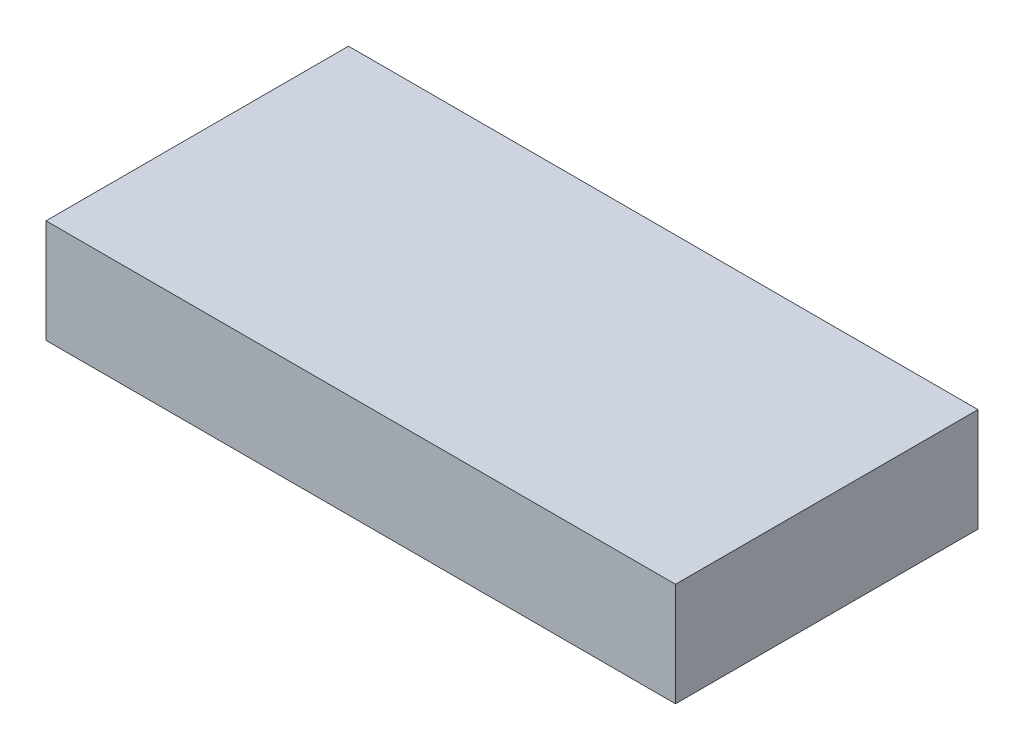
ISO-10303-21;
HEADER;
FILE_DESCRIPTION(('STEP AP214'),'2;1');
FILE_NAME('part.step','',(''),(''),'','','');
FILE_SCHEMA(('AUTOMOTIVE_DESIGN { 1 0 10303 214 1 1 1 1 }'));
ENDSEC;
DATA;
#1=APPLICATION_CONTEXT('core data for automotive mechanical design processes');
#2=APPLICATION_PROTOCOL_DEFINITION('international standard','automotive_design',2000,#1);
#3=PRODUCT_CONTEXT('',#1,'mechanical');
#4=PRODUCT('Part','Part','',(#3));
#5=PRODUCT_RELATED_PRODUCT_CATEGORY('part','',(#4));
#6=PRODUCT_DEFINITION_FORMATION('','',#4);
#7=PRODUCT_DEFINITION_CONTEXT('part definition',#1,'design');
#8=PRODUCT_DEFINITION('design','',#6,#7);
#9=PRODUCT_DEFINITION_SHAPE('','',#8);
#10=(LENGTH_UNIT() NAMED_UNIT(*) SI_UNIT(.MILLI.,.METRE.));
#11=(NAMED_UNIT(*) PLANE_ANGLE_UNIT() SI_UNIT($,.RADIAN.));
#12=(NAMED_UNIT(*) SI_UNIT($,.STERADIAN.) SOLID_ANGLE_UNIT());
#13=UNCERTAINTY_MEASURE_WITH_UNIT(LENGTH_MEASURE(1.E-05),#10,'distance_accuracy_value','');
#14=(GEOMETRIC_REPRESENTATION_CONTEXT(3) GLOBAL_UNCERTAINTY_ASSIGNED_CONTEXT((#13)) GLOBAL_UNIT_ASSIGNED_CONTEXT((#10,
#11,#12)) REPRESENTATION_CONTEXT('',''));
#15=CARTESIAN_POINT('',(0.,0.,0.));
#16=DIRECTION('',(0.,0.,1.));
#17=DIRECTION('',(1.,0.,0.));
#18=AXIS2_PLACEMENT_3D('',#15,#16,#17);
#19=CARTESIAN_POINT('',(183.35625,60.325,88.10625));
#20=DIRECTION('',(-1.,0.,0.));
#21=DIRECTION('',(0.,0.,1.));
#22=AXIS2_PLACEMENT_3D('',#19,#20,#21);
#23=PLANE('',#22);
#24=DIRECTION('',(0.,0.,-1.));
#25=VECTOR('',#24,1.);
#26=CARTESIAN_POINT('',(183.35625,0.,88.10625));
#27=LINE('',#26,#25);
#28=CARTESIAN_POINT('',(183.35625,0.,88.10625));
#29=VERTEX_POINT('',#28);
#30=CARTESIAN_POINT('',(183.35625,0.,-88.10625));
#31=VERTEX_POINT('',#30);
#32=EDGE_CURVE('E96',#29,#31,#27,.T.);
#33=ORIENTED_EDGE('',*,*,#32,.T.);
#34=DIRECTION('',(0.,-1.,0.));
#35=VECTOR('',#34,1.);
#36=CARTESIAN_POINT('',(183.35625,60.325,-88.10625));
#37=LINE('',#36,#35);
#38=CARTESIAN_POINT('',(183.35625,60.325,-88.10625));
#39=VERTEX_POINT('',#38);
#40=EDGE_CURVE('E11',#39,#31,#37,.T.);
#41=ORIENTED_EDGE('',*,*,#40,.F.);
#42=DIRECTION('',(0.,0.,-1.));
#43=VECTOR('',#42,1.);
#44=CARTESIAN_POINT('',(183.35625,60.325,88.10625));
#45=LINE('',#44,#43);
#46=CARTESIAN_POINT('',(183.35625,60.325,88.10625));
#47=VERTEX_POINT('',#46);
#48=EDGE_CURVE('E84',#47,#39,#45,.T.);
#49=ORIENTED_EDGE('',*,*,#48,.F.);
#50=DIRECTION('',(0.,-1.,0.));
#51=VECTOR('',#50,1.);
#52=CARTESIAN_POINT('',(183.35625,60.325,88.10625));
#53=LINE('',#52,#51);
#54=EDGE_CURVE('E92',#47,#29,#53,.T.);
#55=ORIENTED_EDGE('',*,*,#54,.T.);
#56=EDGE_LOOP('',(#33,#41,#49,#55));
#57=FACE_BOUND('',#56,.T.);
#58=ADVANCED_FACE('F33',(#57),#23,.F.);
#59=CARTESIAN_POINT('',(-183.35625,60.325,-88.10625));
#60=DIRECTION('',(0.,0.,1.));
#61=DIRECTION('',(1.,0.,0.));
#62=AXIS2_PLACEMENT_3D('',#59,#60,#61);
#63=PLANE('',#62);
#64=DIRECTION('',(-1.,0.,0.));
#65=VECTOR('',#64,1.);
#66=CARTESIAN_POINT('',(-183.35625,0.,-88.10625));
#67=LINE('',#66,#65);
#68=CARTESIAN_POINT('',(-183.35625,0.,-88.10625));
#69=VERTEX_POINT('',#68);
#70=EDGE_CURVE('E88',#31,#69,#67,.T.);
#71=ORIENTED_EDGE('',*,*,#70,.T.);
#72=DIRECTION('',(0.,-1.,0.));
#73=VECTOR('',#72,1.);
#74=CARTESIAN_POINT('',(-183.35625,60.325,-88.10625));
#75=LINE('',#74,#73);
#76=CARTESIAN_POINT('',(-183.35625,60.325,-88.10625));
#77=VERTEX_POINT('',#76);
#78=EDGE_CURVE('E41',#77,#69,#75,.T.);
#79=ORIENTED_EDGE('',*,*,#78,.F.);
#80=DIRECTION('',(-1.,0.,0.));
#81=VECTOR('',#80,1.);
#82=CARTESIAN_POINT('',(-183.35625,60.325,-88.10625));
#83=LINE('',#82,#81);
#84=EDGE_CURVE('E79',#39,#77,#83,.T.);
#85=ORIENTED_EDGE('',*,*,#84,.F.);
#86=ORIENTED_EDGE('',*,*,#40,.T.);
#87=EDGE_LOOP('',(#71,#79,#85,#86));
#88=FACE_BOUND('',#87,.T.);
#89=ADVANCED_FACE('F87',(#88),#63,.F.);
#90=CARTESIAN_POINT('',(-183.35625,60.325,88.10625));
#91=DIRECTION('',(1.,0.,0.));
#92=DIRECTION('',(0.,0.,-1.));
#93=AXIS2_PLACEMENT_3D('',#90,#91,#92);
#94=PLANE('',#93);
#95=DIRECTION('',(0.,0.,1.));
#96=VECTOR('',#95,1.);
#97=CARTESIAN_POINT('',(-183.35625,0.,88.10625));
#98=LINE('',#97,#96);
#99=CARTESIAN_POINT('',(-183.35625,0.,88.10625));
#100=VERTEX_POINT('',#99);
#101=EDGE_CURVE('E66',#69,#100,#98,.T.);
#102=ORIENTED_EDGE('',*,*,#101,.T.);
#103=DIRECTION('',(0.,-1.,0.));
#104=VECTOR('',#103,1.);
#105=CARTESIAN_POINT('',(-183.35625,60.325,88.10625));
#106=LINE('',#105,#104);
#107=CARTESIAN_POINT('',(-183.35625,60.325,88.10625));
#108=VERTEX_POINT('',#107);
#109=EDGE_CURVE('E89',#108,#100,#106,.T.);
#110=ORIENTED_EDGE('',*,*,#109,.F.);
#111=DIRECTION('',(0.,0.,1.));
#112=VECTOR('',#111,1.);
#113=CARTESIAN_POINT('',(-183.35625,60.325,88.10625));
#114=LINE('',#113,#112);
#115=EDGE_CURVE('E82',#77,#108,#114,.T.);
#116=ORIENTED_EDGE('',*,*,#115,.F.);
#117=ORIENTED_EDGE('',*,*,#78,.T.);
#118=EDGE_LOOP('',(#102,#110,#116,#117));
#119=FACE_BOUND('',#118,.T.);
#120=ADVANCED_FACE('F90',(#119),#94,.F.);
#121=CARTESIAN_POINT('',(-183.35625,60.325,88.10625));
#122=DIRECTION('',(0.,0.,-1.));
#123=DIRECTION('',(-1.,0.,0.));
#124=AXIS2_PLACEMENT_3D('',#121,#122,#123);
#125=PLANE('',#124);
#126=DIRECTION('',(1.,0.,0.));
#127=VECTOR('',#126,1.);
#128=CARTESIAN_POINT('',(-183.35625,0.,88.10625));
#129=LINE('',#128,#127);
#130=EDGE_CURVE('E72',#100,#29,#129,.T.);
#131=ORIENTED_EDGE('',*,*,#130,.T.);
#132=ORIENTED_EDGE('',*,*,#54,.F.);
#133=DIRECTION('',(1.,0.,0.));
#134=VECTOR('',#133,1.);
#135=CARTESIAN_POINT('',(-183.35625,60.325,88.10625));
#136=LINE('',#135,#134);
#137=EDGE_CURVE('E49',#108,#47,#136,.T.);
#138=ORIENTED_EDGE('',*,*,#137,.F.);
#139=ORIENTED_EDGE('',*,*,#109,.T.);
#140=EDGE_LOOP('',(#131,#132,#138,#139));
#141=FACE_BOUND('',#140,.T.);
#142=ADVANCED_FACE('F103',(#141),#125,.F.);
#143=CARTESIAN_POINT('',(0.,60.325,0.));
#144=DIRECTION('',(0.,-1.,0.));
#145=DIRECTION('',(0.,0.,-1.));
#146=AXIS2_PLACEMENT_3D('',#143,#144,#145);
#147=PLANE('',#146);
#148=ORIENTED_EDGE('',*,*,#48,.T.);
#149=ORIENTED_EDGE('',*,*,#84,.T.);
#150=ORIENTED_EDGE('',*,*,#115,.T.);
#151=ORIENTED_EDGE('',*,*,#137,.T.);
#152=EDGE_LOOP('',(#148,#149,#150,#151));
#153=FACE_BOUND('',#152,.T.);
#154=ADVANCED_FACE('F80',(#153),#147,.F.);
#155=CARTESIAN_POINT('',(0.,0.,0.));
#156=DIRECTION('',(0.,-1.,0.));
#157=DIRECTION('',(0.,0.,-1.));
#158=AXIS2_PLACEMENT_3D('',#155,#156,#157);
#159=PLANE('',#158);
#160=ORIENTED_EDGE('',*,*,#32,.F.);
#161=ORIENTED_EDGE('',*,*,#130,.F.);
#162=ORIENTED_EDGE('',*,*,#101,.F.);
#163=ORIENTED_EDGE('',*,*,#70,.F.);
#164=EDGE_LOOP('',(#160,#161,#162,#163));
#165=FACE_BOUND('',#164,.T.);
#166=ADVANCED_FACE('F106',(#165),#159,.T.);
#167=CLOSED_SHELL('',(#58,#89,#120,#142,#154,#166));
#168=MANIFOLD_SOLID_BREP('B2',#167);
#169=ADVANCED_BREP_SHAPE_REPRESENTATION('',(#18,#168),#14);
#170=SHAPE_DEFINITION_REPRESENTATION(#9,#169);
ENDSEC;
END-ISO-10303-21;
